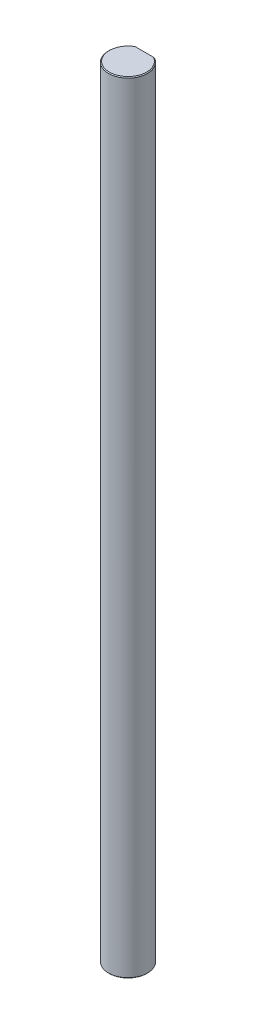
ISO-10303-21;
HEADER;
FILE_DESCRIPTION(('STEP AP214'),'2;1');
FILE_NAME('part.step','',(''),(''),'','','');
FILE_SCHEMA(('AUTOMOTIVE_DESIGN { 1 0 10303 214 1 1 1 1 }'));
ENDSEC;
DATA;
#1=APPLICATION_CONTEXT('core data for automotive mechanical design processes');
#2=APPLICATION_PROTOCOL_DEFINITION('international standard','automotive_design',2000,#1);
#3=PRODUCT_CONTEXT('',#1,'mechanical');
#4=PRODUCT('Part','Part','',(#3));
#5=PRODUCT_RELATED_PRODUCT_CATEGORY('part','',(#4));
#6=PRODUCT_DEFINITION_FORMATION('','',#4);
#7=PRODUCT_DEFINITION_CONTEXT('part definition',#1,'design');
#8=PRODUCT_DEFINITION('design','',#6,#7);
#9=PRODUCT_DEFINITION_SHAPE('','',#8);
#10=(LENGTH_UNIT() NAMED_UNIT(*) SI_UNIT(.MILLI.,.METRE.));
#11=(NAMED_UNIT(*) PLANE_ANGLE_UNIT() SI_UNIT($,.RADIAN.));
#12=(NAMED_UNIT(*) SI_UNIT($,.STERADIAN.) SOLID_ANGLE_UNIT());
#13=UNCERTAINTY_MEASURE_WITH_UNIT(LENGTH_MEASURE(1.E-05),#10,'distance_accuracy_value','');
#14=(GEOMETRIC_REPRESENTATION_CONTEXT(3) GLOBAL_UNCERTAINTY_ASSIGNED_CONTEXT((#13)) GLOBAL_UNIT_ASSIGNED_CONTEXT((#10,
#11,#12)) REPRESENTATION_CONTEXT('',''));
#15=CARTESIAN_POINT('',(0.,0.,0.));
#16=DIRECTION('',(0.,0.,1.));
#17=DIRECTION('',(1.,0.,0.));
#18=AXIS2_PLACEMENT_3D('',#15,#16,#17);
#19=CARTESIAN_POINT('',(0.,120.,0.));
#20=DIRECTION('',(0.,-1.,0.));
#21=DIRECTION('',(0.,0.,-1.));
#22=AXIS2_PLACEMENT_3D('',#19,#20,#21);
#23=CONICAL_SURFACE('',#22,2.875,0.78539816339744);
#24=CARTESIAN_POINT('',(-1.6583123951777,119.875,-2.5));
#25=CARTESIAN_POINT('',(-1.57973572193476,119.918434890403,-2.5));
#26=CARTESIAN_POINT('',(-1.5002290003424,119.960246696465,-2.5));
#27=CARTESIAN_POINT('',(-1.41972708645007,120.,-2.5));
#28=(BOUNDED_CURVE() B_SPLINE_CURVE(3,(#24,#25,#26,#27),.UNSPECIFIED.,.F.,
.F.) B_SPLINE_CURVE_WITH_KNOTS((4,4),(0.,0.000269347265701097),
.UNSPECIFIED.) CURVE() GEOMETRIC_REPRESENTATION_ITEM() RATIONAL_B_SPLINE_CURVE((1.,1.,1.,1.)) REPRESENTATION_ITEM(''));
#29=CARTESIAN_POINT('',(-1.6583123951777,119.875,-2.5));
#30=VERTEX_POINT('',#29);
#31=CARTESIAN_POINT('',(-1.41972708645007,120.,-2.5));
#32=VERTEX_POINT('',#31);
#33=EDGE_CURVE('E120',#30,#32,#28,.T.);
#34=ORIENTED_EDGE('',*,*,#33,.F.);
#35=CARTESIAN_POINT('',(0.,119.875,0.));
#36=DIRECTION('',(0.,-1.,0.));
#37=DIRECTION('',(0.,0.,1.));
#38=AXIS2_PLACEMENT_3D('',#35,#36,#37);
#39=CIRCLE('',#38,3.);
#40=CARTESIAN_POINT('',(1.6583123951777,119.875,-2.5));
#41=VERTEX_POINT('',#40);
#42=EDGE_CURVE('E19',#41,#30,#39,.T.);
#43=ORIENTED_EDGE('',*,*,#42,.F.);
#44=CARTESIAN_POINT('',(1.41972708645007,120.,-2.5));
#45=CARTESIAN_POINT('',(1.50022900034239,119.960246696465,-2.5));
#46=CARTESIAN_POINT('',(1.57973572193476,119.918434890404,-2.5));
#47=CARTESIAN_POINT('',(1.6583123951777,119.875,-2.5));
#48=(BOUNDED_CURVE() B_SPLINE_CURVE(3,(#44,#45,#46,#47),.UNSPECIFIED.,.F.,
.F.) B_SPLINE_CURVE_WITH_KNOTS((4,4),(0.,0.000269347265701097),
.UNSPECIFIED.) CURVE() GEOMETRIC_REPRESENTATION_ITEM() RATIONAL_B_SPLINE_CURVE((1.,1.,1.,1.)) REPRESENTATION_ITEM(''));
#49=CARTESIAN_POINT('',(1.41972708645007,120.,-2.5));
#50=VERTEX_POINT('',#49);
#51=EDGE_CURVE('E76',#50,#41,#48,.T.);
#52=ORIENTED_EDGE('',*,*,#51,.F.);
#53=CARTESIAN_POINT('',(0.,120.,0.));
#54=DIRECTION('',(0.,1.,0.));
#55=DIRECTION('',(0.,0.,1.));
#56=AXIS2_PLACEMENT_3D('',#53,#54,#55);
#57=CIRCLE('',#56,2.875);
#58=EDGE_CURVE('E25',#32,#50,#57,.T.);
#59=ORIENTED_EDGE('',*,*,#58,.F.);
#60=EDGE_LOOP('',(#34,#43,#52,#59));
#61=FACE_BOUND('',#60,.T.);
#62=ADVANCED_FACE('F15',(#61),#23,.T.);
#63=CARTESIAN_POINT('',(0.,0.125,0.));
#64=DIRECTION('',(0.,1.,0.));
#65=DIRECTION('',(0.,0.,1.));
#66=AXIS2_PLACEMENT_3D('',#63,#64,#65);
#67=CONICAL_SURFACE('',#66,3.,0.785398163397493);
#68=DIRECTION('',(0.,0.707106781186516,0.707106781186579));
#69=VECTOR('',#68,1.);
#70=CARTESIAN_POINT('',(0.,0.125,3.));
#71=LINE('',#70,#69);
#72=CARTESIAN_POINT('',(0.,0.,2.875));
#73=VERTEX_POINT('',#72);
#74=CARTESIAN_POINT('',(0.,0.125,3.));
#75=VERTEX_POINT('',#74);
#76=EDGE_CURVE('E118',#73,#75,#71,.T.);
#77=ORIENTED_EDGE('',*,*,#76,.F.);
#78=CARTESIAN_POINT('',(0.,0.,0.));
#79=DIRECTION('',(0.,-1.,0.));
#80=DIRECTION('',(0.,0.,1.));
#81=AXIS2_PLACEMENT_3D('',#78,#79,#80);
#82=CIRCLE('',#81,2.875);
#83=CARTESIAN_POINT('',(1.41972708645005,0.,-2.5));
#84=VERTEX_POINT('',#83);
#85=EDGE_CURVE('E10',#84,#73,#82,.T.);
#86=ORIENTED_EDGE('',*,*,#85,.F.);
#87=CARTESIAN_POINT('',(1.6583123951777,0.125,-2.5));
#88=CARTESIAN_POINT('',(1.57973572193475,0.0815651095964658,-2.5));
#89=CARTESIAN_POINT('',(1.50022900034238,0.0397533035352765,-2.5));
#90=CARTESIAN_POINT('',(1.41972708645005,0.,-2.5));
#91=(BOUNDED_CURVE() B_SPLINE_CURVE(3,(#87,#88,#89,#90),.UNSPECIFIED.,.F.,
.F.) B_SPLINE_CURVE_WITH_KNOTS((4,4),(0.,0.00026934726570112),
.UNSPECIFIED.) CURVE() GEOMETRIC_REPRESENTATION_ITEM() RATIONAL_B_SPLINE_CURVE((1.,1.,1.,1.)) REPRESENTATION_ITEM(''));
#92=CARTESIAN_POINT('',(1.6583123951777,0.125,-2.5));
#93=VERTEX_POINT('',#92);
#94=EDGE_CURVE('E84',#93,#84,#91,.T.);
#95=ORIENTED_EDGE('',*,*,#94,.F.);
#96=CARTESIAN_POINT('',(0.,0.125,0.));
#97=DIRECTION('',(0.,1.,0.));
#98=DIRECTION('',(0.,0.,1.));
#99=AXIS2_PLACEMENT_3D('',#96,#97,#98);
#100=CIRCLE('',#99,3.);
#101=EDGE_CURVE('E87',#75,#93,#100,.T.);
#102=ORIENTED_EDGE('',*,*,#101,.F.);
#103=EDGE_LOOP('',(#77,#86,#95,#102));
#104=FACE_BOUND('',#103,.T.);
#105=ADVANCED_FACE('F17',(#104),#67,.T.);
#106=CARTESIAN_POINT('',(0.,0.,0.));
#107=DIRECTION('',(0.,1.,0.));
#108=DIRECTION('',(1.,0.,0.));
#109=AXIS2_PLACEMENT_3D('',#106,#107,#108);
#110=PLANE('',#109);
#111=DIRECTION('',(1.,0.,0.));
#112=VECTOR('',#111,1.);
#113=CARTESIAN_POINT('',(0.,0.,-2.5));
#114=LINE('',#113,#112);
#115=CARTESIAN_POINT('',(-1.41972708645005,0.,-2.5));
#116=VERTEX_POINT('',#115);
#117=EDGE_CURVE('E91',#116,#84,#114,.T.);
#118=ORIENTED_EDGE('',*,*,#117,.T.);
#119=ORIENTED_EDGE('',*,*,#85,.T.);
#120=CARTESIAN_POINT('',(0.,0.,0.));
#121=DIRECTION('',(0.,-1.,0.));
#122=DIRECTION('',(0.,0.,1.));
#123=AXIS2_PLACEMENT_3D('',#120,#121,#122);
#124=CIRCLE('',#123,2.875);
#125=EDGE_CURVE('E140',#73,#116,#124,.T.);
#126=ORIENTED_EDGE('',*,*,#125,.T.);
#127=EDGE_LOOP('',(#118,#119,#126));
#128=FACE_BOUND('',#127,.T.);
#129=ADVANCED_FACE('F153',(#128),#110,.F.);
#130=CARTESIAN_POINT('',(0.,120.,0.));
#131=DIRECTION('',(0.,1.,0.));
#132=DIRECTION('',(1.,0.,0.));
#133=AXIS2_PLACEMENT_3D('',#130,#131,#132);
#134=PLANE('',#133);
#135=DIRECTION('',(1.,0.,0.));
#136=VECTOR('',#135,1.);
#137=CARTESIAN_POINT('',(0.,120.,-2.5));
#138=LINE('',#137,#136);
#139=EDGE_CURVE('E114',#32,#50,#138,.T.);
#140=ORIENTED_EDGE('',*,*,#139,.F.);
#141=ORIENTED_EDGE('',*,*,#58,.T.);
#142=EDGE_LOOP('',(#140,#141));
#143=FACE_BOUND('',#142,.T.);
#144=ADVANCED_FACE('F191',(#143),#134,.T.);
#145=CARTESIAN_POINT('',(0.,120.,-2.5));
#146=DIRECTION('',(0.,0.,-1.));
#147=DIRECTION('',(0.,-1.,0.));
#148=AXIS2_PLACEMENT_3D('',#145,#146,#147);
#149=PLANE('',#148);
#150=DIRECTION('',(0.,-1.,0.));
#151=VECTOR('',#150,1.);
#152=CARTESIAN_POINT('',(1.6583123951777,120.,-2.5));
#153=LINE('',#152,#151);
#154=EDGE_CURVE('E94',#41,#93,#153,.T.);
#155=ORIENTED_EDGE('',*,*,#154,.T.);
#156=ORIENTED_EDGE('',*,*,#94,.T.);
#157=ORIENTED_EDGE('',*,*,#117,.F.);
#158=CARTESIAN_POINT('',(-1.41972708645005,0.,-2.5));
#159=CARTESIAN_POINT('',(-1.50022900034237,0.0397533035353007,-2.5));
#160=CARTESIAN_POINT('',(-1.57973572193476,0.0815651095964535,-2.5));
#161=CARTESIAN_POINT('',(-1.6583123951777,0.125,-2.5));
#162=(BOUNDED_CURVE() B_SPLINE_CURVE(3,(#158,#159,#160,#161),.UNSPECIFIED.,.F.,
.F.) B_SPLINE_CURVE_WITH_KNOTS((4,4),(0.,0.00026934726570112),
.UNSPECIFIED.) CURVE() GEOMETRIC_REPRESENTATION_ITEM() RATIONAL_B_SPLINE_CURVE((1.,1.,1.,1.)) REPRESENTATION_ITEM(''));
#163=CARTESIAN_POINT('',(-1.6583123951777,0.125,-2.5));
#164=VERTEX_POINT('',#163);
#165=EDGE_CURVE('E111',#116,#164,#162,.T.);
#166=ORIENTED_EDGE('',*,*,#165,.T.);
#167=DIRECTION('',(0.,-1.,0.));
#168=VECTOR('',#167,1.);
#169=CARTESIAN_POINT('',(-1.6583123951777,120.,-2.5));
#170=LINE('',#169,#168);
#171=EDGE_CURVE('E105',#30,#164,#170,.T.);
#172=ORIENTED_EDGE('',*,*,#171,.F.);
#173=ORIENTED_EDGE('',*,*,#33,.T.);
#174=ORIENTED_EDGE('',*,*,#139,.T.);
#175=ORIENTED_EDGE('',*,*,#51,.T.);
#176=EDGE_LOOP('',(#155,#156,#157,#166,#172,#173,#174,#175));
#177=FACE_BOUND('',#176,.T.);
#178=ADVANCED_FACE('F95',(#177),#149,.T.);
#179=CARTESIAN_POINT('',(0.,120.,0.));
#180=DIRECTION('',(0.,-1.,0.));
#181=DIRECTION('',(0.,0.,-1.));
#182=AXIS2_PLACEMENT_3D('',#179,#180,#181);
#183=CYLINDRICAL_SURFACE('',#182,3.);
#184=ORIENTED_EDGE('',*,*,#171,.T.);
#185=CARTESIAN_POINT('',(0.,0.125,0.));
#186=DIRECTION('',(0.,1.,0.));
#187=DIRECTION('',(0.,0.,1.));
#188=AXIS2_PLACEMENT_3D('',#185,#186,#187);
#189=CIRCLE('',#188,3.);
#190=EDGE_CURVE('E102',#164,#75,#189,.T.);
#191=ORIENTED_EDGE('',*,*,#190,.T.);
#192=ORIENTED_EDGE('',*,*,#101,.T.);
#193=ORIENTED_EDGE('',*,*,#154,.F.);
#194=ORIENTED_EDGE('',*,*,#42,.T.);
#195=EDGE_LOOP('',(#184,#191,#192,#193,#194));
#196=FACE_BOUND('',#195,.T.);
#197=ADVANCED_FACE('F100',(#196),#183,.T.);
#198=CARTESIAN_POINT('',(0.,0.125,0.));
#199=DIRECTION('',(0.,1.,0.));
#200=DIRECTION('',(0.,0.,1.));
#201=AXIS2_PLACEMENT_3D('',#198,#199,#200);
#202=CONICAL_SURFACE('',#201,3.,0.785398163397493);
#203=ORIENTED_EDGE('',*,*,#125,.F.);
#204=ORIENTED_EDGE('',*,*,#76,.T.);
#205=ORIENTED_EDGE('',*,*,#190,.F.);
#206=ORIENTED_EDGE('',*,*,#165,.F.);
#207=EDGE_LOOP('',(#203,#204,#205,#206));
#208=FACE_BOUND('',#207,.T.);
#209=ADVANCED_FACE('F156',(#208),#202,.T.);
#210=CLOSED_SHELL('',(#62,#105,#129,#144,#178,#197,#209));
#211=MANIFOLD_SOLID_BREP('B1',#210);
#212=ADVANCED_BREP_SHAPE_REPRESENTATION('',(#18,#211),#14);
#213=SHAPE_DEFINITION_REPRESENTATION(#9,#212);
ENDSEC;
END-ISO-10303-21;
